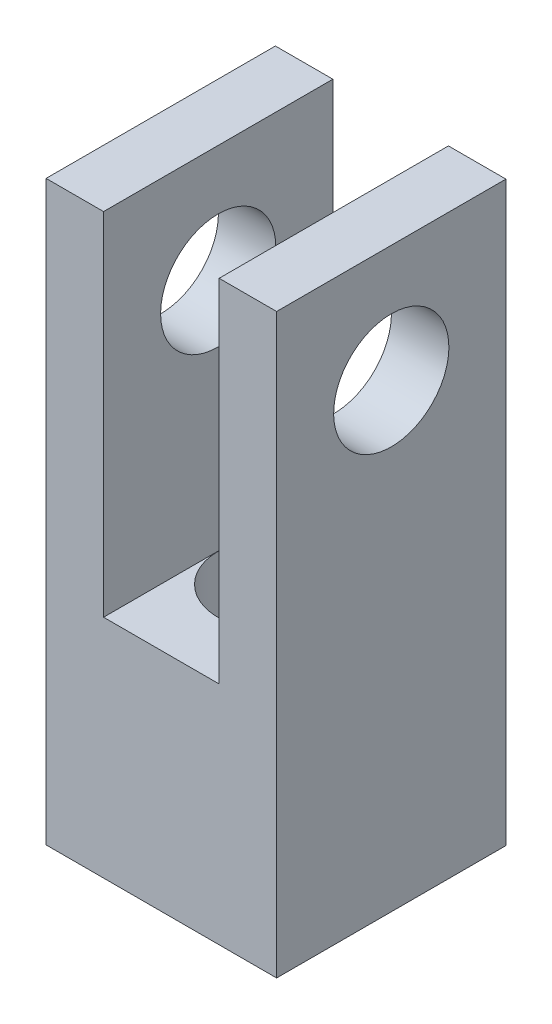
ISO-10303-21;
HEADER;
FILE_DESCRIPTION(('STEP AP214'),'2;1');
FILE_NAME('part.step','',(''),(''),'','','');
FILE_SCHEMA(('AUTOMOTIVE_DESIGN { 1 0 10303 214 1 1 1 1 }'));
ENDSEC;
DATA;
#1=APPLICATION_CONTEXT('core data for automotive mechanical design processes');
#2=APPLICATION_PROTOCOL_DEFINITION('international standard','automotive_design',2000,#1);
#3=PRODUCT_CONTEXT('',#1,'mechanical');
#4=PRODUCT('Part','Part','',(#3));
#5=PRODUCT_RELATED_PRODUCT_CATEGORY('part','',(#4));
#6=PRODUCT_DEFINITION_FORMATION('','',#4);
#7=PRODUCT_DEFINITION_CONTEXT('part definition',#1,'design');
#8=PRODUCT_DEFINITION('design','',#6,#7);
#9=PRODUCT_DEFINITION_SHAPE('','',#8);
#10=(LENGTH_UNIT() NAMED_UNIT(*) SI_UNIT(.MILLI.,.METRE.));
#11=(NAMED_UNIT(*) PLANE_ANGLE_UNIT() SI_UNIT($,.RADIAN.));
#12=(NAMED_UNIT(*) SI_UNIT($,.STERADIAN.) SOLID_ANGLE_UNIT());
#13=UNCERTAINTY_MEASURE_WITH_UNIT(LENGTH_MEASURE(1.E-05),#10,'distance_accuracy_value','');
#14=(GEOMETRIC_REPRESENTATION_CONTEXT(3) GLOBAL_UNCERTAINTY_ASSIGNED_CONTEXT((#13)) GLOBAL_UNIT_ASSIGNED_CONTEXT((#10,
#11,#12)) REPRESENTATION_CONTEXT('',''));
#15=CARTESIAN_POINT('',(0.,0.,0.));
#16=DIRECTION('',(0.,0.,1.));
#17=DIRECTION('',(1.,0.,0.));
#18=AXIS2_PLACEMENT_3D('',#15,#16,#17);
#19=CARTESIAN_POINT('',(-2.3876,-9.68375,4.7371));
#20=DIRECTION('',(-1.,0.,0.));
#21=DIRECTION('',(0.,-1.,0.));
#22=AXIS2_PLACEMENT_3D('',#19,#20,#21);
#23=PLANE('',#22);
#24=CARTESIAN_POINT('',(-2.3876,0.,0.));
#25=DIRECTION('',(-1.,0.,0.));
#26=DIRECTION('',(0.,-1.,0.));
#27=AXIS2_PLACEMENT_3D('',#24,#25,#26);
#28=CIRCLE('',#27,2.38125);
#29=CARTESIAN_POINT('',(-2.3876,-2.38125,0.));
#30=VERTEX_POINT('',#29);
#31=EDGE_CURVE('E184',#30,#30,#28,.T.);
#32=ORIENTED_EDGE('',*,*,#31,.T.);
#33=EDGE_LOOP('',(#32));
#34=FACE_BOUND('',#33,.T.);
#35=DIRECTION('',(0.,1.,0.));
#36=VECTOR('',#35,1.);
#37=CARTESIAN_POINT('',(-2.3876,-9.68375,-4.7371));
#38=LINE('',#37,#36);
#39=CARTESIAN_POINT('',(-2.3876,-9.68375,-4.7371));
#40=VERTEX_POINT('',#39);
#41=CARTESIAN_POINT('',(-2.3876,4.83235,-4.7371));
#42=VERTEX_POINT('',#41);
#43=EDGE_CURVE('E130',#40,#42,#38,.T.);
#44=ORIENTED_EDGE('',*,*,#43,.T.);
#45=DIRECTION('',(0.,0.,-1.));
#46=VECTOR('',#45,1.);
#47=CARTESIAN_POINT('',(-2.3876,4.83235,4.7371));
#48=LINE('',#47,#46);
#49=CARTESIAN_POINT('',(-2.3876,4.83235,4.7371));
#50=VERTEX_POINT('',#49);
#51=EDGE_CURVE('E11',#50,#42,#48,.T.);
#52=ORIENTED_EDGE('',*,*,#51,.F.);
#53=DIRECTION('',(0.,1.,0.));
#54=VECTOR('',#53,1.);
#55=CARTESIAN_POINT('',(-2.3876,-9.68375,4.7371));
#56=LINE('',#55,#54);
#57=CARTESIAN_POINT('',(-2.3876,-9.68375,4.7371));
#58=VERTEX_POINT('',#57);
#59=EDGE_CURVE('E145',#58,#50,#56,.T.);
#60=ORIENTED_EDGE('',*,*,#59,.F.);
#61=DIRECTION('',(0.,0.,-1.));
#62=VECTOR('',#61,1.);
#63=CARTESIAN_POINT('',(-2.3876,-9.68375,4.7371));
#64=LINE('',#63,#62);
#65=EDGE_CURVE('E126',#58,#40,#64,.T.);
#66=ORIENTED_EDGE('',*,*,#65,.T.);
#67=EDGE_LOOP('',(#44,#52,#60,#66));
#68=FACE_BOUND('',#67,.T.);
#69=ADVANCED_FACE('F33',(#34,#68),#23,.F.);
#70=CARTESIAN_POINT('',(-2.3876,4.83235,4.7371));
#71=DIRECTION('',(0.,-1.,0.));
#72=DIRECTION('',(0.,0.,-1.));
#73=AXIS2_PLACEMENT_3D('',#70,#71,#72);
#74=PLANE('',#73);
#75=DIRECTION('',(-1.,0.,0.));
#76=VECTOR('',#75,1.);
#77=CARTESIAN_POINT('',(-2.3876,4.83235,-4.7371));
#78=LINE('',#77,#76);
#79=CARTESIAN_POINT('',(-4.7625,4.83235,-4.7371));
#80=VERTEX_POINT('',#79);
#81=EDGE_CURVE('E133',#42,#80,#78,.T.);
#82=ORIENTED_EDGE('',*,*,#81,.T.);
#83=DIRECTION('',(0.,0.,-1.));
#84=VECTOR('',#83,1.);
#85=CARTESIAN_POINT('',(-4.7625,4.83235,4.7371));
#86=LINE('',#85,#84);
#87=CARTESIAN_POINT('',(-4.7625,4.83235,4.7371));
#88=VERTEX_POINT('',#87);
#89=EDGE_CURVE('E42',#88,#80,#86,.T.);
#90=ORIENTED_EDGE('',*,*,#89,.F.);
#91=DIRECTION('',(-1.,0.,0.));
#92=VECTOR('',#91,1.);
#93=CARTESIAN_POINT('',(-2.3876,4.83235,4.7371));
#94=LINE('',#93,#92);
#95=EDGE_CURVE('E93',#50,#88,#94,.T.);
#96=ORIENTED_EDGE('',*,*,#95,.F.);
#97=ORIENTED_EDGE('',*,*,#51,.T.);
#98=EDGE_LOOP('',(#82,#90,#96,#97));
#99=FACE_BOUND('',#98,.T.);
#100=ADVANCED_FACE('F212',(#99),#74,.F.);
#101=CARTESIAN_POINT('',(-4.7625,4.83235,4.7371));
#102=DIRECTION('',(1.,0.,0.));
#103=DIRECTION('',(0.,1.,0.));
#104=AXIS2_PLACEMENT_3D('',#101,#102,#103);
#105=PLANE('',#104);
#106=CARTESIAN_POINT('',(-4.76250000000001,0.,0.));
#107=DIRECTION('',(1.,0.,0.));
#108=DIRECTION('',(0.,1.,0.));
#109=AXIS2_PLACEMENT_3D('',#106,#107,#108);
#110=CIRCLE('',#109,2.38125);
#111=CARTESIAN_POINT('',(-4.76250000000001,2.38125,0.));
#112=VERTEX_POINT('',#111);
#113=EDGE_CURVE('E190',#112,#112,#110,.T.);
#114=ORIENTED_EDGE('',*,*,#113,.T.);
#115=EDGE_LOOP('',(#114));
#116=FACE_BOUND('',#115,.T.);
#117=DIRECTION('',(0.,-1.,0.));
#118=VECTOR('',#117,1.);
#119=CARTESIAN_POINT('',(-4.7625,4.83235,-4.7371));
#120=LINE('',#119,#118);
#121=CARTESIAN_POINT('',(-4.7625,-19.01825,-4.7371));
#122=VERTEX_POINT('',#121);
#123=EDGE_CURVE('E136',#80,#122,#120,.T.);
#124=ORIENTED_EDGE('',*,*,#123,.T.);
#125=DIRECTION('',(0.,0.,-1.));
#126=VECTOR('',#125,1.);
#127=CARTESIAN_POINT('',(-4.7625,-19.01825,4.7371));
#128=LINE('',#127,#126);
#129=CARTESIAN_POINT('',(-4.7625,-19.01825,4.7371));
#130=VERTEX_POINT('',#129);
#131=EDGE_CURVE('E152',#130,#122,#128,.T.);
#132=ORIENTED_EDGE('',*,*,#131,.F.);
#133=DIRECTION('',(0.,-1.,0.));
#134=VECTOR('',#133,1.);
#135=CARTESIAN_POINT('',(-4.7625,4.83235,4.7371));
#136=LINE('',#135,#134);
#137=EDGE_CURVE('E161',#88,#130,#136,.T.);
#138=ORIENTED_EDGE('',*,*,#137,.F.);
#139=ORIENTED_EDGE('',*,*,#89,.T.);
#140=EDGE_LOOP('',(#124,#132,#138,#139));
#141=FACE_BOUND('',#140,.T.);
#142=ADVANCED_FACE('F159',(#116,#141),#105,.F.);
#143=CARTESIAN_POINT('',(-4.7625,-19.01825,4.7371));
#144=DIRECTION('',(0.,1.,0.));
#145=DIRECTION('',(0.,0.,1.));
#146=AXIS2_PLACEMENT_3D('',#143,#144,#145);
#147=PLANE('',#146);
#148=CARTESIAN_POINT('',(0.,-19.01825,0.));
#149=DIRECTION('',(0.,-1.,0.));
#150=DIRECTION('',(0.,0.,-1.));
#151=AXIS2_PLACEMENT_3D('',#148,#149,#150);
#152=CIRCLE('',#151,2.38125);
#153=CARTESIAN_POINT('',(0.,-19.01825,-2.38125));
#154=VERTEX_POINT('',#153);
#155=EDGE_CURVE('E181',#154,#154,#152,.T.);
#156=ORIENTED_EDGE('',*,*,#155,.F.);
#157=EDGE_LOOP('',(#156));
#158=FACE_BOUND('',#157,.T.);
#159=DIRECTION('',(1.,0.,0.));
#160=VECTOR('',#159,1.);
#161=CARTESIAN_POINT('',(-4.7625,-19.01825,-4.7371));
#162=LINE('',#161,#160);
#163=CARTESIAN_POINT('',(4.7625,-19.01825,-4.7371));
#164=VERTEX_POINT('',#163);
#165=EDGE_CURVE('E138',#122,#164,#162,.T.);
#166=ORIENTED_EDGE('',*,*,#165,.T.);
#167=DIRECTION('',(0.,0.,-1.));
#168=VECTOR('',#167,1.);
#169=CARTESIAN_POINT('',(4.7625,-19.01825,4.7371));
#170=LINE('',#169,#168);
#171=CARTESIAN_POINT('',(4.7625,-19.01825,4.7371));
#172=VERTEX_POINT('',#171);
#173=EDGE_CURVE('E149',#172,#164,#170,.T.);
#174=ORIENTED_EDGE('',*,*,#173,.F.);
#175=DIRECTION('',(1.,0.,0.));
#176=VECTOR('',#175,1.);
#177=CARTESIAN_POINT('',(-4.7625,-19.01825,4.7371));
#178=LINE('',#177,#176);
#179=EDGE_CURVE('E173',#130,#172,#178,.T.);
#180=ORIENTED_EDGE('',*,*,#179,.F.);
#181=ORIENTED_EDGE('',*,*,#131,.T.);
#182=EDGE_LOOP('',(#166,#174,#180,#181));
#183=FACE_BOUND('',#182,.T.);
#184=ADVANCED_FACE('F169',(#158,#183),#147,.F.);
#185=CARTESIAN_POINT('',(4.7625,4.83235,4.7371));
#186=DIRECTION('',(-1.,0.,0.));
#187=DIRECTION('',(0.,-1.,0.));
#188=AXIS2_PLACEMENT_3D('',#185,#186,#187);
#189=PLANE('',#188);
#190=CARTESIAN_POINT('',(4.7625,0.,0.));
#191=DIRECTION('',(1.,0.,0.));
#192=DIRECTION('',(0.,1.,0.));
#193=AXIS2_PLACEMENT_3D('',#190,#191,#192);
#194=CIRCLE('',#193,2.38125);
#195=CARTESIAN_POINT('',(4.7625,2.38125,0.));
#196=VERTEX_POINT('',#195);
#197=EDGE_CURVE('E187',#196,#196,#194,.T.);
#198=ORIENTED_EDGE('',*,*,#197,.F.);
#199=EDGE_LOOP('',(#198));
#200=FACE_BOUND('',#199,.T.);
#201=DIRECTION('',(0.,1.,0.));
#202=VECTOR('',#201,1.);
#203=CARTESIAN_POINT('',(4.7625,4.83235,-4.7371));
#204=LINE('',#203,#202);
#205=CARTESIAN_POINT('',(4.7625,4.83235,-4.7371));
#206=VERTEX_POINT('',#205);
#207=EDGE_CURVE('E140',#164,#206,#204,.T.);
#208=ORIENTED_EDGE('',*,*,#207,.T.);
#209=DIRECTION('',(0.,0.,-1.));
#210=VECTOR('',#209,1.);
#211=CARTESIAN_POINT('',(4.7625,4.83235,4.7371));
#212=LINE('',#211,#210);
#213=CARTESIAN_POINT('',(4.7625,4.83235,4.7371));
#214=VERTEX_POINT('',#213);
#215=EDGE_CURVE('E121',#214,#206,#212,.T.);
#216=ORIENTED_EDGE('',*,*,#215,.F.);
#217=DIRECTION('',(0.,1.,0.));
#218=VECTOR('',#217,1.);
#219=CARTESIAN_POINT('',(4.7625,4.83235,4.7371));
#220=LINE('',#219,#218);
#221=EDGE_CURVE('E112',#172,#214,#220,.T.);
#222=ORIENTED_EDGE('',*,*,#221,.F.);
#223=ORIENTED_EDGE('',*,*,#173,.T.);
#224=EDGE_LOOP('',(#208,#216,#222,#223));
#225=FACE_BOUND('',#224,.T.);
#226=ADVANCED_FACE('F172',(#200,#225),#189,.F.);
#227=CARTESIAN_POINT('',(2.3876,4.83235,4.7371));
#228=DIRECTION('',(0.,-1.,0.));
#229=DIRECTION('',(1.,0.,0.));
#230=AXIS2_PLACEMENT_3D('',#227,#228,#229);
#231=PLANE('',#230);
#232=DIRECTION('',(-1.,0.,0.));
#233=VECTOR('',#232,1.);
#234=CARTESIAN_POINT('',(2.3876,4.83235,-4.7371));
#235=LINE('',#234,#233);
#236=CARTESIAN_POINT('',(2.3876,4.83235,-4.7371));
#237=VERTEX_POINT('',#236);
#238=EDGE_CURVE('E120',#206,#237,#235,.T.);
#239=ORIENTED_EDGE('',*,*,#238,.T.);
#240=DIRECTION('',(0.,0.,-1.));
#241=VECTOR('',#240,1.);
#242=CARTESIAN_POINT('',(2.3876,4.83235,4.7371));
#243=LINE('',#242,#241);
#244=CARTESIAN_POINT('',(2.3876,4.83235,4.7371));
#245=VERTEX_POINT('',#244);
#246=EDGE_CURVE('E117',#245,#237,#243,.T.);
#247=ORIENTED_EDGE('',*,*,#246,.F.);
#248=DIRECTION('',(-1.,0.,0.));
#249=VECTOR('',#248,1.);
#250=CARTESIAN_POINT('',(2.3876,4.83235,4.7371));
#251=LINE('',#250,#249);
#252=EDGE_CURVE('E106',#214,#245,#251,.T.);
#253=ORIENTED_EDGE('',*,*,#252,.F.);
#254=ORIENTED_EDGE('',*,*,#215,.T.);
#255=EDGE_LOOP('',(#239,#247,#253,#254));
#256=FACE_BOUND('',#255,.T.);
#257=ADVANCED_FACE('F118',(#256),#231,.F.);
#258=CARTESIAN_POINT('',(2.3876,-9.68375,4.7371));
#259=DIRECTION('',(1.,0.,0.));
#260=DIRECTION('',(0.,1.,0.));
#261=AXIS2_PLACEMENT_3D('',#258,#259,#260);
#262=PLANE('',#261);
#263=CARTESIAN_POINT('',(2.3876,0.,0.));
#264=DIRECTION('',(1.,0.,0.));
#265=DIRECTION('',(0.,1.,0.));
#266=AXIS2_PLACEMENT_3D('',#263,#264,#265);
#267=CIRCLE('',#266,2.38125);
#268=CARTESIAN_POINT('',(2.3876,2.38125,0.));
#269=VERTEX_POINT('',#268);
#270=EDGE_CURVE('E36',#269,#269,#267,.T.);
#271=ORIENTED_EDGE('',*,*,#270,.T.);
#272=EDGE_LOOP('',(#271));
#273=FACE_BOUND('',#272,.T.);
#274=DIRECTION('',(0.,-1.,0.));
#275=VECTOR('',#274,1.);
#276=CARTESIAN_POINT('',(2.3876,-9.68375,-4.7371));
#277=LINE('',#276,#275);
#278=CARTESIAN_POINT('',(2.3876,-9.68375,-4.7371));
#279=VERTEX_POINT('',#278);
#280=EDGE_CURVE('E79',#237,#279,#277,.T.);
#281=ORIENTED_EDGE('',*,*,#280,.T.);
#282=DIRECTION('',(0.,0.,-1.));
#283=VECTOR('',#282,1.);
#284=CARTESIAN_POINT('',(2.3876,-9.68375,4.7371));
#285=LINE('',#284,#283);
#286=CARTESIAN_POINT('',(2.3876,-9.68375,4.7371));
#287=VERTEX_POINT('',#286);
#288=EDGE_CURVE('E122',#287,#279,#285,.T.);
#289=ORIENTED_EDGE('',*,*,#288,.F.);
#290=DIRECTION('',(0.,-1.,0.));
#291=VECTOR('',#290,1.);
#292=CARTESIAN_POINT('',(2.3876,-9.68375,4.7371));
#293=LINE('',#292,#291);
#294=EDGE_CURVE('E110',#245,#287,#293,.T.);
#295=ORIENTED_EDGE('',*,*,#294,.F.);
#296=ORIENTED_EDGE('',*,*,#246,.T.);
#297=EDGE_LOOP('',(#281,#289,#295,#296));
#298=FACE_BOUND('',#297,.T.);
#299=ADVANCED_FACE('F124',(#273,#298),#262,.F.);
#300=CARTESIAN_POINT('',(2.3876,-9.68375,4.7371));
#301=DIRECTION('',(0.,-1.,0.));
#302=DIRECTION('',(0.,0.,-1.));
#303=AXIS2_PLACEMENT_3D('',#300,#301,#302);
#304=PLANE('',#303);
#305=CARTESIAN_POINT('',(0.,-9.68375,0.));
#306=DIRECTION('',(0.,-1.,0.));
#307=DIRECTION('',(0.,0.,-1.));
#308=AXIS2_PLACEMENT_3D('',#305,#306,#307);
#309=CIRCLE('',#308,2.38125);
#310=CARTESIAN_POINT('',(0.,-9.68375,-2.38125));
#311=VERTEX_POINT('',#310);
#312=EDGE_CURVE('E134',#311,#311,#309,.F.);
#313=ORIENTED_EDGE('',*,*,#312,.F.);
#314=EDGE_LOOP('',(#313));
#315=FACE_BOUND('',#314,.T.);
#316=DIRECTION('',(-1.,0.,0.));
#317=VECTOR('',#316,1.);
#318=CARTESIAN_POINT('',(2.3876,-9.68375,-4.7371));
#319=LINE('',#318,#317);
#320=EDGE_CURVE('E85',#279,#40,#319,.T.);
#321=ORIENTED_EDGE('',*,*,#320,.T.);
#322=ORIENTED_EDGE('',*,*,#65,.F.);
#323=DIRECTION('',(-1.,0.,0.));
#324=VECTOR('',#323,1.);
#325=CARTESIAN_POINT('',(2.3876,-9.68375,4.7371));
#326=LINE('',#325,#324);
#327=EDGE_CURVE('E50',#287,#58,#326,.T.);
#328=ORIENTED_EDGE('',*,*,#327,.F.);
#329=ORIENTED_EDGE('',*,*,#288,.T.);
#330=EDGE_LOOP('',(#321,#322,#328,#329));
#331=FACE_BOUND('',#330,.T.);
#332=ADVANCED_FACE('F221',(#315,#331),#304,.F.);
#333=CARTESIAN_POINT('',(0.,0.,4.7371));
#334=DIRECTION('',(0.,0.,1.));
#335=DIRECTION('',(1.,0.,0.));
#336=AXIS2_PLACEMENT_3D('',#333,#334,#335);
#337=PLANE('',#336);
#338=ORIENTED_EDGE('',*,*,#59,.T.);
#339=ORIENTED_EDGE('',*,*,#95,.T.);
#340=ORIENTED_EDGE('',*,*,#137,.T.);
#341=ORIENTED_EDGE('',*,*,#179,.T.);
#342=ORIENTED_EDGE('',*,*,#221,.T.);
#343=ORIENTED_EDGE('',*,*,#252,.T.);
#344=ORIENTED_EDGE('',*,*,#294,.T.);
#345=ORIENTED_EDGE('',*,*,#327,.T.);
#346=EDGE_LOOP('',(#338,#339,#340,#341,#342,#343,#344,#345));
#347=FACE_BOUND('',#346,.T.);
#348=ADVANCED_FACE('F108',(#347),#337,.T.);
#349=CARTESIAN_POINT('',(0.,0.,-4.7371));
#350=DIRECTION('',(0.,0.,1.));
#351=DIRECTION('',(1.,0.,0.));
#352=AXIS2_PLACEMENT_3D('',#349,#350,#351);
#353=PLANE('',#352);
#354=ORIENTED_EDGE('',*,*,#43,.F.);
#355=ORIENTED_EDGE('',*,*,#320,.F.);
#356=ORIENTED_EDGE('',*,*,#280,.F.);
#357=ORIENTED_EDGE('',*,*,#238,.F.);
#358=ORIENTED_EDGE('',*,*,#207,.F.);
#359=ORIENTED_EDGE('',*,*,#165,.F.);
#360=ORIENTED_EDGE('',*,*,#123,.F.);
#361=ORIENTED_EDGE('',*,*,#81,.F.);
#362=EDGE_LOOP('',(#354,#355,#356,#357,#358,#359,#360,#361));
#363=FACE_BOUND('',#362,.T.);
#364=ADVANCED_FACE('F165',(#363),#353,.F.);
#365=CARTESIAN_POINT('',(0.,4.83335,0.));
#366=DIRECTION('',(0.,-1.,0.));
#367=DIRECTION('',(0.,0.,-1.));
#368=AXIS2_PLACEMENT_3D('',#365,#366,#367);
#369=CYLINDRICAL_SURFACE('',#368,2.38125);
#370=ORIENTED_EDGE('',*,*,#155,.T.);
#371=EDGE_LOOP('',(#370));
#372=FACE_BOUND('',#371,.T.);
#373=ORIENTED_EDGE('',*,*,#312,.T.);
#374=EDGE_LOOP('',(#373));
#375=FACE_BOUND('',#374,.T.);
#376=ADVANCED_FACE('F201',(#372,#375),#369,.F.);
#377=CARTESIAN_POINT('',(-4.76250000000001,0.,0.));
#378=DIRECTION('',(1.,0.,0.));
#379=DIRECTION('',(0.,1.,0.));
#380=AXIS2_PLACEMENT_3D('',#377,#378,#379);
#381=CYLINDRICAL_SURFACE('',#380,2.38125);
#382=ORIENTED_EDGE('',*,*,#197,.T.);
#383=EDGE_LOOP('',(#382));
#384=FACE_BOUND('',#383,.T.);
#385=ORIENTED_EDGE('',*,*,#270,.F.);
#386=EDGE_LOOP('',(#385));
#387=FACE_BOUND('',#386,.T.);
#388=ADVANCED_FACE('F198',(#384,#387),#381,.F.);
#389=ORIENTED_EDGE('',*,*,#113,.F.);
#390=EDGE_LOOP('',(#389));
#391=FACE_BOUND('',#390,.T.);
#392=ORIENTED_EDGE('',*,*,#31,.F.);
#393=EDGE_LOOP('',(#392));
#394=FACE_BOUND('',#393,.T.);
#395=ADVANCED_FACE('F200',(#391,#394),#381,.F.);
#396=CLOSED_SHELL('',(#69,#100,#142,#184,#226,#257,#299,#332,#348,#364,#376,#388,#395));
#397=MANIFOLD_SOLID_BREP('B2',#396);
#398=ADVANCED_BREP_SHAPE_REPRESENTATION('',(#18,#397),#14);
#399=SHAPE_DEFINITION_REPRESENTATION(#9,#398);
ENDSEC;
END-ISO-10303-21;
